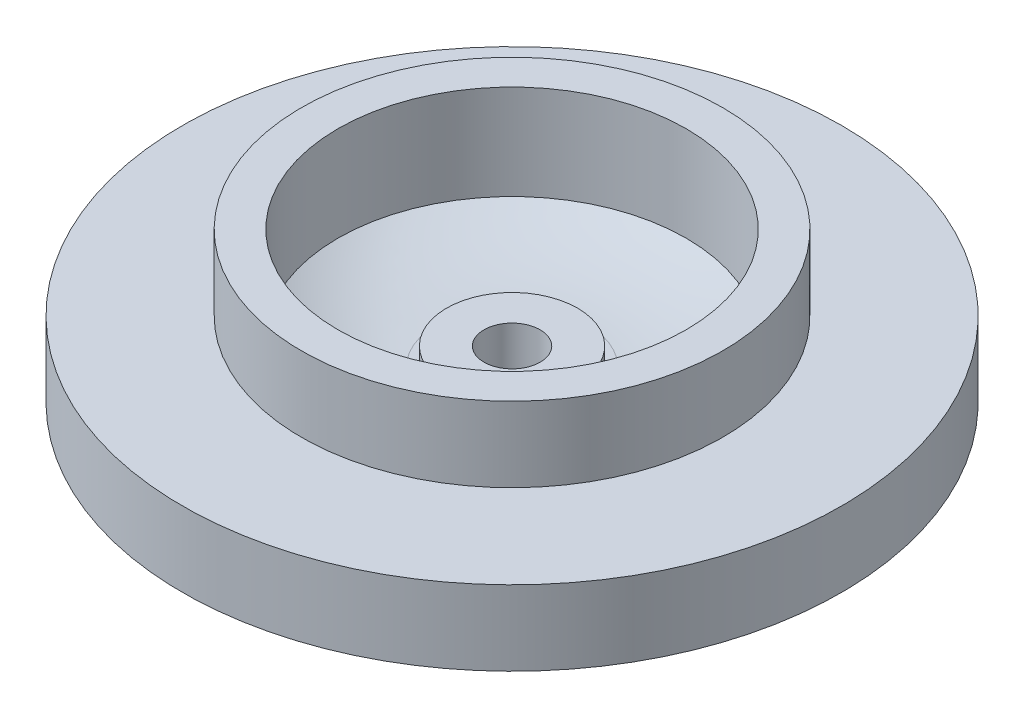
ISO-10303-21;
HEADER;
FILE_DESCRIPTION(('STEP AP214'),'2;1');
FILE_NAME('part.step','',(''),(''),'','','');
FILE_SCHEMA(('AUTOMOTIVE_DESIGN { 1 0 10303 214 1 1 1 1 }'));
ENDSEC;
DATA;
#1=APPLICATION_CONTEXT('core data for automotive mechanical design processes');
#2=APPLICATION_PROTOCOL_DEFINITION('international standard','automotive_design',2000,#1);
#3=PRODUCT_CONTEXT('',#1,'mechanical');
#4=PRODUCT('Part','Part','',(#3));
#5=PRODUCT_RELATED_PRODUCT_CATEGORY('part','',(#4));
#6=PRODUCT_DEFINITION_FORMATION('','',#4);
#7=PRODUCT_DEFINITION_CONTEXT('part definition',#1,'design');
#8=PRODUCT_DEFINITION('design','',#6,#7);
#9=PRODUCT_DEFINITION_SHAPE('','',#8);
#10=(LENGTH_UNIT() NAMED_UNIT(*) SI_UNIT(.MILLI.,.METRE.));
#11=(NAMED_UNIT(*) PLANE_ANGLE_UNIT() SI_UNIT($,.RADIAN.));
#12=(NAMED_UNIT(*) SI_UNIT($,.STERADIAN.) SOLID_ANGLE_UNIT());
#13=UNCERTAINTY_MEASURE_WITH_UNIT(LENGTH_MEASURE(1.E-05),#10,'distance_accuracy_value','');
#14=(GEOMETRIC_REPRESENTATION_CONTEXT(3) GLOBAL_UNCERTAINTY_ASSIGNED_CONTEXT((#13)) GLOBAL_UNIT_ASSIGNED_CONTEXT((#10,
#11,#12)) REPRESENTATION_CONTEXT('',''));
#15=CARTESIAN_POINT('',(0.,0.,0.));
#16=DIRECTION('',(0.,0.,1.));
#17=DIRECTION('',(1.,0.,0.));
#18=AXIS2_PLACEMENT_3D('',#15,#16,#17);
#19=CARTESIAN_POINT('',(-17.6,1.5,0.));
#20=DIRECTION('',(0.,1.,0.));
#21=DIRECTION('',(0.,0.,1.));
#22=AXIS2_PLACEMENT_3D('',#19,#20,#21);
#23=PLANE('',#22);
#24=CARTESIAN_POINT('',(0.,1.5,0.));
#25=DIRECTION('',(0.,-1.,0.));
#26=DIRECTION('',(0.,0.,-1.));
#27=AXIS2_PLACEMENT_3D('',#24,#25,#26);
#28=CIRCLE('',#27,16.6);
#29=CARTESIAN_POINT('',(0.,1.5,-16.6));
#30=VERTEX_POINT('',#29);
#31=EDGE_CURVE('E85',#30,#30,#28,.T.);
#32=ORIENTED_EDGE('',*,*,#31,.F.);
#33=EDGE_LOOP('',(#32));
#34=FACE_BOUND('',#33,.T.);
#35=CARTESIAN_POINT('',(0.,1.5,0.));
#36=DIRECTION('',(0.,-1.,0.));
#37=DIRECTION('',(0.,0.,-1.));
#38=AXIS2_PLACEMENT_3D('',#35,#36,#37);
#39=CIRCLE('',#38,17.6);
#40=CARTESIAN_POINT('',(0.,1.5,-17.6));
#41=VERTEX_POINT('',#40);
#42=EDGE_CURVE('E10',#41,#41,#39,.T.);
#43=ORIENTED_EDGE('',*,*,#42,.T.);
#44=EDGE_LOOP('',(#43));
#45=FACE_BOUND('',#44,.T.);
#46=ADVANCED_FACE('F30',(#34,#45),#23,.F.);
#47=CARTESIAN_POINT('',(0.,0.,0.));
#48=DIRECTION('',(0.,-1.,0.));
#49=DIRECTION('',(0.,0.,-1.));
#50=AXIS2_PLACEMENT_3D('',#47,#48,#49);
#51=CYLINDRICAL_SURFACE('',#50,17.6);
#52=ORIENTED_EDGE('',*,*,#42,.F.);
#53=EDGE_LOOP('',(#52));
#54=FACE_BOUND('',#53,.T.);
#55=CARTESIAN_POINT('',(0.,5.5,0.));
#56=DIRECTION('',(0.,-1.,0.));
#57=DIRECTION('',(0.,0.,-1.));
#58=AXIS2_PLACEMENT_3D('',#55,#56,#57);
#59=CIRCLE('',#58,17.6);
#60=CARTESIAN_POINT('',(0.,5.5,-17.6));
#61=VERTEX_POINT('',#60);
#62=EDGE_CURVE('E37',#61,#61,#59,.T.);
#63=ORIENTED_EDGE('',*,*,#62,.T.);
#64=EDGE_LOOP('',(#63));
#65=FACE_BOUND('',#64,.T.);
#66=ADVANCED_FACE('F109',(#54,#65),#51,.T.);
#67=CARTESIAN_POINT('',(-17.6,5.5,0.));
#68=DIRECTION('',(0.,-1.,0.));
#69=DIRECTION('',(0.,0.,-1.));
#70=AXIS2_PLACEMENT_3D('',#67,#68,#69);
#71=PLANE('',#70);
#72=ORIENTED_EDGE('',*,*,#62,.F.);
#73=EDGE_LOOP('',(#72));
#74=FACE_BOUND('',#73,.T.);
#75=CARTESIAN_POINT('',(0.,5.5,0.));
#76=DIRECTION('',(0.,-1.,0.));
#77=DIRECTION('',(0.,0.,-1.));
#78=AXIS2_PLACEMENT_3D('',#75,#76,#77);
#79=CIRCLE('',#78,11.25);
#80=CARTESIAN_POINT('',(0.,5.5,-11.25));
#81=VERTEX_POINT('',#80);
#82=EDGE_CURVE('E41',#81,#81,#79,.T.);
#83=ORIENTED_EDGE('',*,*,#82,.T.);
#84=EDGE_LOOP('',(#83));
#85=FACE_BOUND('',#84,.T.);
#86=ADVANCED_FACE('F114',(#74,#85),#71,.F.);
#87=CARTESIAN_POINT('',(0.,0.,0.));
#88=DIRECTION('',(0.,-1.,0.));
#89=DIRECTION('',(0.,0.,-1.));
#90=AXIS2_PLACEMENT_3D('',#87,#88,#89);
#91=CYLINDRICAL_SURFACE('',#90,11.25);
#92=ORIENTED_EDGE('',*,*,#82,.F.);
#93=EDGE_LOOP('',(#92));
#94=FACE_BOUND('',#93,.T.);
#95=CARTESIAN_POINT('',(0.,9.5,0.));
#96=DIRECTION('',(0.,-1.,0.));
#97=DIRECTION('',(0.,0.,-1.));
#98=AXIS2_PLACEMENT_3D('',#95,#96,#97);
#99=CIRCLE('',#98,11.25);
#100=CARTESIAN_POINT('',(0.,9.5,-11.25));
#101=VERTEX_POINT('',#100);
#102=EDGE_CURVE('E46',#101,#101,#99,.T.);
#103=ORIENTED_EDGE('',*,*,#102,.T.);
#104=EDGE_LOOP('',(#103));
#105=FACE_BOUND('',#104,.T.);
#106=ADVANCED_FACE('F121',(#94,#105),#91,.T.);
#107=CARTESIAN_POINT('',(-11.25,9.5,0.));
#108=DIRECTION('',(0.,-1.,0.));
#109=DIRECTION('',(0.,0.,-1.));
#110=AXIS2_PLACEMENT_3D('',#107,#108,#109);
#111=PLANE('',#110);
#112=ORIENTED_EDGE('',*,*,#102,.F.);
#113=EDGE_LOOP('',(#112));
#114=FACE_BOUND('',#113,.T.);
#115=CARTESIAN_POINT('',(0.,9.5,0.));
#116=DIRECTION('',(0.,-1.,0.));
#117=DIRECTION('',(0.,0.,-1.));
#118=AXIS2_PLACEMENT_3D('',#115,#116,#117);
#119=CIRCLE('',#118,9.3);
#120=CARTESIAN_POINT('',(0.,9.5,-9.3));
#121=VERTEX_POINT('',#120);
#122=EDGE_CURVE('E49',#121,#121,#119,.T.);
#123=ORIENTED_EDGE('',*,*,#122,.T.);
#124=EDGE_LOOP('',(#123));
#125=FACE_BOUND('',#124,.T.);
#126=ADVANCED_FACE('F128',(#114,#125),#111,.F.);
#127=CARTESIAN_POINT('',(0.,0.,0.));
#128=DIRECTION('',(0.,-1.,0.));
#129=DIRECTION('',(0.,0.,-1.));
#130=AXIS2_PLACEMENT_3D('',#127,#128,#129);
#131=CYLINDRICAL_SURFACE('',#130,9.3);
#132=ORIENTED_EDGE('',*,*,#122,.F.);
#133=EDGE_LOOP('',(#132));
#134=FACE_BOUND('',#133,.T.);
#135=CARTESIAN_POINT('',(0.,4.43592869683777,0.));
#136=DIRECTION('',(0.,-1.,0.));
#137=DIRECTION('',(0.,0.,-1.));
#138=AXIS2_PLACEMENT_3D('',#135,#136,#137);
#139=CIRCLE('',#138,9.3);
#140=CARTESIAN_POINT('',(0.,4.43592869683777,-9.3));
#141=VERTEX_POINT('',#140);
#142=EDGE_CURVE('E52',#141,#141,#139,.T.);
#143=ORIENTED_EDGE('',*,*,#142,.T.);
#144=EDGE_LOOP('',(#143));
#145=FACE_BOUND('',#144,.T.);
#146=ADVANCED_FACE('F132',(#134,#145),#131,.F.);
#147=CARTESIAN_POINT('',(0.,14.28125,0.));
#148=DIRECTION('',(0.,-1.,0.));
#149=DIRECTION('',(0.,0.,-1.));
#150=AXIS2_PLACEMENT_3D('',#147,#148,#149);
#151=DEGENERATE_TOROIDAL_SURFACE('',#150,4.,11.18125,.T.);
#152=ORIENTED_EDGE('',*,*,#142,.F.);
#153=EDGE_LOOP('',(#152));
#154=FACE_BOUND('',#153,.T.);
#155=CARTESIAN_POINT('',(0.,3.1,0.));
#156=DIRECTION('',(0.,-1.,0.));
#157=DIRECTION('',(0.,0.,-1.));
#158=AXIS2_PLACEMENT_3D('',#155,#156,#157);
#159=CIRCLE('',#158,4.);
#160=CARTESIAN_POINT('',(0.,3.1,-4.));
#161=VERTEX_POINT('',#160);
#162=EDGE_CURVE('E55',#161,#161,#159,.T.);
#163=ORIENTED_EDGE('',*,*,#162,.T.);
#164=EDGE_LOOP('',(#163));
#165=FACE_BOUND('',#164,.T.);
#166=ADVANCED_FACE('F136',(#154,#165),#151,.F.);
#167=CARTESIAN_POINT('',(-4.,3.1,0.));
#168=DIRECTION('',(0.,-1.,0.));
#169=DIRECTION('',(0.,0.,-1.));
#170=AXIS2_PLACEMENT_3D('',#167,#168,#169);
#171=PLANE('',#170);
#172=ORIENTED_EDGE('',*,*,#162,.F.);
#173=EDGE_LOOP('',(#172));
#174=FACE_BOUND('',#173,.T.);
#175=CARTESIAN_POINT('',(0.,3.1,0.));
#176=DIRECTION('',(0.,-1.,0.));
#177=DIRECTION('',(0.,0.,-1.));
#178=AXIS2_PLACEMENT_3D('',#175,#176,#177);
#179=CIRCLE('',#178,3.5);
#180=CARTESIAN_POINT('',(0.,3.1,-3.5));
#181=VERTEX_POINT('',#180);
#182=EDGE_CURVE('E58',#181,#181,#179,.T.);
#183=ORIENTED_EDGE('',*,*,#182,.T.);
#184=EDGE_LOOP('',(#183));
#185=FACE_BOUND('',#184,.T.);
#186=ADVANCED_FACE('F140',(#174,#185),#171,.F.);
#187=CARTESIAN_POINT('',(0.,0.,0.));
#188=DIRECTION('',(0.,-1.,0.));
#189=DIRECTION('',(0.,0.,-1.));
#190=AXIS2_PLACEMENT_3D('',#187,#188,#189);
#191=CYLINDRICAL_SURFACE('',#190,3.5);
#192=ORIENTED_EDGE('',*,*,#182,.F.);
#193=EDGE_LOOP('',(#192));
#194=FACE_BOUND('',#193,.T.);
#195=CARTESIAN_POINT('',(0.,4.1,0.));
#196=DIRECTION('',(0.,-1.,0.));
#197=DIRECTION('',(0.,0.,-1.));
#198=AXIS2_PLACEMENT_3D('',#195,#196,#197);
#199=CIRCLE('',#198,3.5);
#200=CARTESIAN_POINT('',(0.,4.1,-3.5));
#201=VERTEX_POINT('',#200);
#202=EDGE_CURVE('E61',#201,#201,#199,.T.);
#203=ORIENTED_EDGE('',*,*,#202,.T.);
#204=EDGE_LOOP('',(#203));
#205=FACE_BOUND('',#204,.T.);
#206=ADVANCED_FACE('F144',(#194,#205),#191,.T.);
#207=CARTESIAN_POINT('',(-3.5,4.1,0.));
#208=DIRECTION('',(0.,-1.,0.));
#209=DIRECTION('',(0.,0.,-1.));
#210=AXIS2_PLACEMENT_3D('',#207,#208,#209);
#211=PLANE('',#210);
#212=CARTESIAN_POINT('',(0.,4.1,0.));
#213=DIRECTION('',(0.,1.,0.));
#214=DIRECTION('',(0.,0.,1.));
#215=AXIS2_PLACEMENT_3D('',#212,#213,#214);
#216=CIRCLE('',#215,1.5);
#217=CARTESIAN_POINT('',(0.,4.1,1.5));
#218=VERTEX_POINT('',#217);
#219=EDGE_CURVE('E88',#218,#218,#216,.T.);
#220=ORIENTED_EDGE('',*,*,#219,.F.);
#221=EDGE_LOOP('',(#220));
#222=FACE_BOUND('',#221,.T.);
#223=ORIENTED_EDGE('',*,*,#202,.F.);
#224=EDGE_LOOP('',(#223));
#225=FACE_BOUND('',#224,.T.);
#226=ADVANCED_FACE('F148',(#222,#225),#211,.F.);
#227=CARTESIAN_POINT('',(-4.,0.,0.));
#228=DIRECTION('',(0.,1.,0.));
#229=DIRECTION('',(0.,0.,1.));
#230=AXIS2_PLACEMENT_3D('',#227,#228,#229);
#231=PLANE('',#230);
#232=CARTESIAN_POINT('',(0.,0.,0.));
#233=DIRECTION('',(0.,1.,0.));
#234=DIRECTION('',(0.,0.,1.));
#235=AXIS2_PLACEMENT_3D('',#232,#233,#234);
#236=CIRCLE('',#235,1.5);
#237=CARTESIAN_POINT('',(0.,0.,1.5));
#238=VERTEX_POINT('',#237);
#239=EDGE_CURVE('E33',#238,#238,#236,.T.);
#240=ORIENTED_EDGE('',*,*,#239,.T.);
#241=EDGE_LOOP('',(#240));
#242=FACE_BOUND('',#241,.T.);
#243=CARTESIAN_POINT('',(0.,0.,0.));
#244=DIRECTION('',(0.,-1.,0.));
#245=DIRECTION('',(0.,0.,-1.));
#246=AXIS2_PLACEMENT_3D('',#243,#244,#245);
#247=CIRCLE('',#246,4.);
#248=CARTESIAN_POINT('',(0.,0.,-4.));
#249=VERTEX_POINT('',#248);
#250=EDGE_CURVE('E64',#249,#249,#247,.T.);
#251=ORIENTED_EDGE('',*,*,#250,.T.);
#252=EDGE_LOOP('',(#251));
#253=FACE_BOUND('',#252,.T.);
#254=ADVANCED_FACE('F95',(#242,#253),#231,.F.);
#255=CARTESIAN_POINT('',(0.,0.,0.));
#256=DIRECTION('',(0.,-1.,0.));
#257=DIRECTION('',(0.,0.,-1.));
#258=AXIS2_PLACEMENT_3D('',#255,#256,#257);
#259=CYLINDRICAL_SURFACE('',#258,4.);
#260=ORIENTED_EDGE('',*,*,#250,.F.);
#261=EDGE_LOOP('',(#260));
#262=FACE_BOUND('',#261,.T.);
#263=CARTESIAN_POINT('',(0.,2.5,0.));
#264=DIRECTION('',(0.,-1.,0.));
#265=DIRECTION('',(0.,0.,-1.));
#266=AXIS2_PLACEMENT_3D('',#263,#264,#265);
#267=CIRCLE('',#266,4.);
#268=CARTESIAN_POINT('',(0.,2.5,-4.));
#269=VERTEX_POINT('',#268);
#270=EDGE_CURVE('E67',#269,#269,#267,.T.);
#271=ORIENTED_EDGE('',*,*,#270,.T.);
#272=EDGE_LOOP('',(#271));
#273=FACE_BOUND('',#272,.T.);
#274=ADVANCED_FACE('F155',(#262,#273),#259,.T.);
#275=CARTESIAN_POINT('',(0.,14.28125,0.));
#276=DIRECTION('',(0.,-1.,0.));
#277=DIRECTION('',(0.,0.,-1.));
#278=AXIS2_PLACEMENT_3D('',#275,#276,#277);
#279=DEGENERATE_TOROIDAL_SURFACE('',#278,4.,11.78125,.T.);
#280=ORIENTED_EDGE('',*,*,#270,.F.);
#281=EDGE_LOOP('',(#280));
#282=FACE_BOUND('',#281,.T.);
#283=CARTESIAN_POINT('',(0.,3.5,0.));
#284=DIRECTION('',(0.,-1.,0.));
#285=DIRECTION('',(0.,0.,-1.));
#286=AXIS2_PLACEMENT_3D('',#283,#284,#285);
#287=CIRCLE('',#286,8.75);
#288=CARTESIAN_POINT('',(0.,3.5,-8.75));
#289=VERTEX_POINT('',#288);
#290=EDGE_CURVE('E70',#289,#289,#287,.T.);
#291=ORIENTED_EDGE('',*,*,#290,.T.);
#292=EDGE_LOOP('',(#291));
#293=FACE_BOUND('',#292,.T.);
#294=ADVANCED_FACE('F158',(#282,#293),#279,.T.);
#295=CARTESIAN_POINT('',(0.,0.,0.));
#296=DIRECTION('',(0.,-1.,0.));
#297=DIRECTION('',(0.,0.,-1.));
#298=AXIS2_PLACEMENT_3D('',#295,#296,#297);
#299=CYLINDRICAL_SURFACE('',#298,8.75);
#300=ORIENTED_EDGE('',*,*,#290,.F.);
#301=EDGE_LOOP('',(#300));
#302=FACE_BOUND('',#301,.T.);
#303=CARTESIAN_POINT('',(0.,0.,0.));
#304=DIRECTION('',(0.,-1.,0.));
#305=DIRECTION('',(0.,0.,-1.));
#306=AXIS2_PLACEMENT_3D('',#303,#304,#305);
#307=CIRCLE('',#306,8.75);
#308=CARTESIAN_POINT('',(0.,0.,-8.75));
#309=VERTEX_POINT('',#308);
#310=EDGE_CURVE('E73',#309,#309,#307,.T.);
#311=ORIENTED_EDGE('',*,*,#310,.T.);
#312=EDGE_LOOP('',(#311));
#313=FACE_BOUND('',#312,.T.);
#314=ADVANCED_FACE('F162',(#302,#313),#299,.F.);
#315=CARTESIAN_POINT('',(-13.5,0.,0.));
#316=DIRECTION('',(0.,1.,0.));
#317=DIRECTION('',(0.,0.,1.));
#318=AXIS2_PLACEMENT_3D('',#315,#316,#317);
#319=PLANE('',#318);
#320=ORIENTED_EDGE('',*,*,#310,.F.);
#321=EDGE_LOOP('',(#320));
#322=FACE_BOUND('',#321,.T.);
#323=CARTESIAN_POINT('',(0.,0.,0.));
#324=DIRECTION('',(0.,-1.,0.));
#325=DIRECTION('',(0.,0.,-1.));
#326=AXIS2_PLACEMENT_3D('',#323,#324,#325);
#327=CIRCLE('',#326,13.5);
#328=CARTESIAN_POINT('',(0.,0.,-13.5));
#329=VERTEX_POINT('',#328);
#330=EDGE_CURVE('E76',#329,#329,#327,.T.);
#331=ORIENTED_EDGE('',*,*,#330,.T.);
#332=EDGE_LOOP('',(#331));
#333=FACE_BOUND('',#332,.T.);
#334=ADVANCED_FACE('F166',(#322,#333),#319,.F.);
#335=CARTESIAN_POINT('',(0.,0.,0.));
#336=DIRECTION('',(0.,-1.,0.));
#337=DIRECTION('',(0.,0.,-1.));
#338=AXIS2_PLACEMENT_3D('',#335,#336,#337);
#339=CYLINDRICAL_SURFACE('',#338,13.5);
#340=ORIENTED_EDGE('',*,*,#330,.F.);
#341=EDGE_LOOP('',(#340));
#342=FACE_BOUND('',#341,.T.);
#343=CARTESIAN_POINT('',(0.,3.,0.));
#344=DIRECTION('',(0.,-1.,0.));
#345=DIRECTION('',(0.,0.,-1.));
#346=AXIS2_PLACEMENT_3D('',#343,#344,#345);
#347=CIRCLE('',#346,13.5);
#348=CARTESIAN_POINT('',(0.,3.,-13.5));
#349=VERTEX_POINT('',#348);
#350=EDGE_CURVE('E79',#349,#349,#347,.T.);
#351=ORIENTED_EDGE('',*,*,#350,.T.);
#352=EDGE_LOOP('',(#351));
#353=FACE_BOUND('',#352,.T.);
#354=ADVANCED_FACE('F170',(#342,#353),#339,.T.);
#355=CARTESIAN_POINT('',(-16.6,3.,0.));
#356=DIRECTION('',(0.,1.,0.));
#357=DIRECTION('',(0.,0.,1.));
#358=AXIS2_PLACEMENT_3D('',#355,#356,#357);
#359=PLANE('',#358);
#360=ORIENTED_EDGE('',*,*,#350,.F.);
#361=EDGE_LOOP('',(#360));
#362=FACE_BOUND('',#361,.T.);
#363=CARTESIAN_POINT('',(0.,3.,0.));
#364=DIRECTION('',(0.,-1.,0.));
#365=DIRECTION('',(0.,0.,-1.));
#366=AXIS2_PLACEMENT_3D('',#363,#364,#365);
#367=CIRCLE('',#366,16.6);
#368=CARTESIAN_POINT('',(0.,3.,-16.6));
#369=VERTEX_POINT('',#368);
#370=EDGE_CURVE('E82',#369,#369,#367,.T.);
#371=ORIENTED_EDGE('',*,*,#370,.T.);
#372=EDGE_LOOP('',(#371));
#373=FACE_BOUND('',#372,.T.);
#374=ADVANCED_FACE('F105',(#362,#373),#359,.F.);
#375=CARTESIAN_POINT('',(0.,0.,0.));
#376=DIRECTION('',(0.,-1.,0.));
#377=DIRECTION('',(0.,0.,-1.));
#378=AXIS2_PLACEMENT_3D('',#375,#376,#377);
#379=CYLINDRICAL_SURFACE('',#378,16.6);
#380=ORIENTED_EDGE('',*,*,#370,.F.);
#381=EDGE_LOOP('',(#380));
#382=FACE_BOUND('',#381,.T.);
#383=ORIENTED_EDGE('',*,*,#31,.T.);
#384=EDGE_LOOP('',(#383));
#385=FACE_BOUND('',#384,.T.);
#386=ADVANCED_FACE('F100',(#382,#385),#379,.F.);
#387=CARTESIAN_POINT('',(0.,-5.9,0.));
#388=DIRECTION('',(0.,1.,0.));
#389=DIRECTION('',(0.,0.,1.));
#390=AXIS2_PLACEMENT_3D('',#387,#388,#389);
#391=CYLINDRICAL_SURFACE('',#390,1.5);
#392=ORIENTED_EDGE('',*,*,#219,.T.);
#393=EDGE_LOOP('',(#392));
#394=FACE_BOUND('',#393,.T.);
#395=ORIENTED_EDGE('',*,*,#239,.F.);
#396=EDGE_LOOP('',(#395));
#397=FACE_BOUND('',#396,.T.);
#398=ADVANCED_FACE('F98',(#394,#397),#391,.F.);
#399=CLOSED_SHELL('',(#46,#66,#86,#106,#126,#146,#166,#186,#206,#226,#254,#274,#294,#314,#334,
#354,#374,#386,#398));
#400=MANIFOLD_SOLID_BREP('B2',#399);
#401=ADVANCED_BREP_SHAPE_REPRESENTATION('',(#18,#400),#14);
#402=SHAPE_DEFINITION_REPRESENTATION(#9,#401);
ENDSEC;
END-ISO-10303-21;
